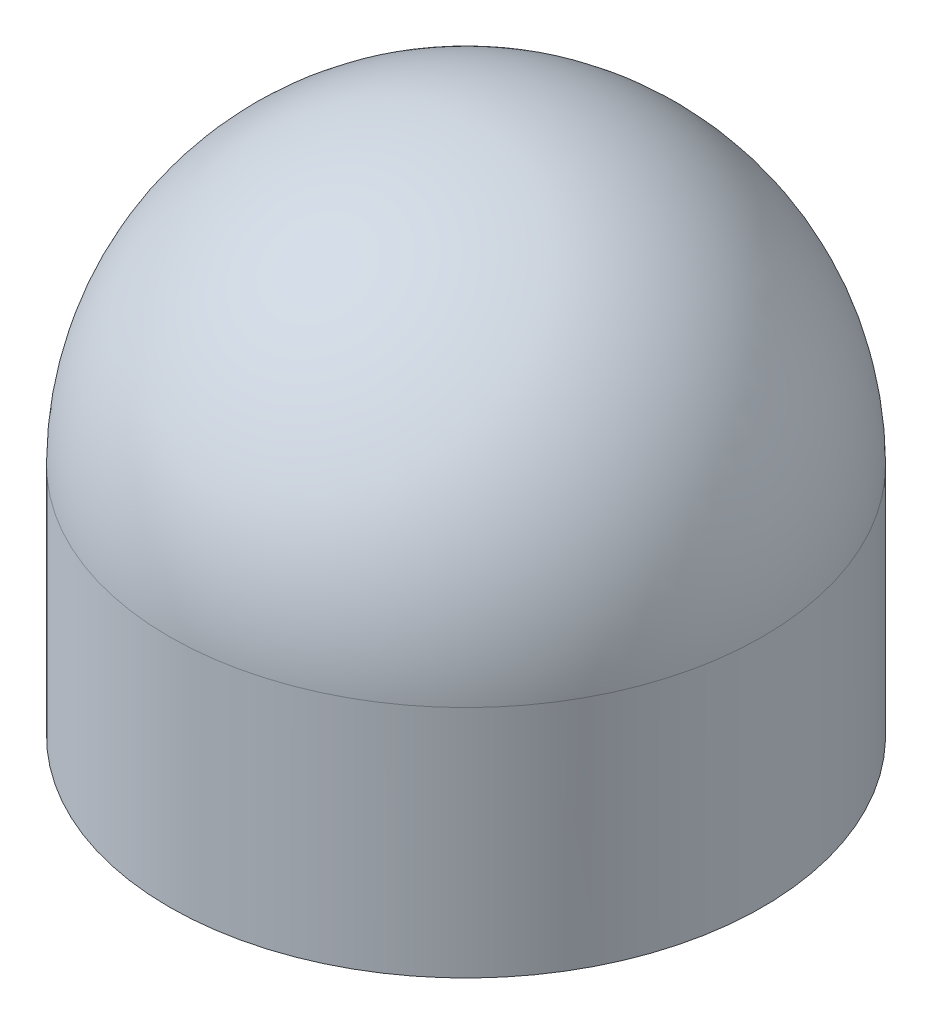
ISO-10303-21;
HEADER;
FILE_DESCRIPTION(('STEP AP214'),'2;1');
FILE_NAME('part.step','',(''),(''),'','','');
FILE_SCHEMA(('AUTOMOTIVE_DESIGN { 1 0 10303 214 1 1 1 1 }'));
ENDSEC;
DATA;
#1=APPLICATION_CONTEXT('core data for automotive mechanical design processes');
#2=APPLICATION_PROTOCOL_DEFINITION('international standard','automotive_design',2000,#1);
#3=PRODUCT_CONTEXT('',#1,'mechanical');
#4=PRODUCT('Part','Part','',(#3));
#5=PRODUCT_RELATED_PRODUCT_CATEGORY('part','',(#4));
#6=PRODUCT_DEFINITION_FORMATION('','',#4);
#7=PRODUCT_DEFINITION_CONTEXT('part definition',#1,'design');
#8=PRODUCT_DEFINITION('design','',#6,#7);
#9=PRODUCT_DEFINITION_SHAPE('','',#8);
#10=(LENGTH_UNIT() NAMED_UNIT(*) SI_UNIT(.MILLI.,.METRE.));
#11=(NAMED_UNIT(*) PLANE_ANGLE_UNIT() SI_UNIT($,.RADIAN.));
#12=(NAMED_UNIT(*) SI_UNIT($,.STERADIAN.) SOLID_ANGLE_UNIT());
#13=UNCERTAINTY_MEASURE_WITH_UNIT(LENGTH_MEASURE(1.E-05),#10,'distance_accuracy_value','');
#14=(GEOMETRIC_REPRESENTATION_CONTEXT(3) GLOBAL_UNCERTAINTY_ASSIGNED_CONTEXT((#13)) GLOBAL_UNIT_ASSIGNED_CONTEXT((#10,
#11,#12)) REPRESENTATION_CONTEXT('',''));
#15=CARTESIAN_POINT('',(0.,0.,0.));
#16=DIRECTION('',(0.,0.,1.));
#17=DIRECTION('',(1.,0.,0.));
#18=AXIS2_PLACEMENT_3D('',#15,#16,#17);
#19=CARTESIAN_POINT('',(0.,0.,0.));
#20=DIRECTION('',(0.,1.,0.));
#21=DIRECTION('',(0.,0.,1.));
#22=AXIS2_PLACEMENT_3D('',#19,#20,#21);
#23=PLANE('',#22);
#24=CARTESIAN_POINT('',(0.,0.,0.));
#25=DIRECTION('',(0.,1.,0.));
#26=DIRECTION('',(0.,0.,1.));
#27=AXIS2_PLACEMENT_3D('',#24,#25,#26);
#28=CIRCLE('',#27,9.652);
#29=CARTESIAN_POINT('',(0.,0.,9.652));
#30=VERTEX_POINT('',#29);
#31=EDGE_CURVE('E10',#30,#30,#28,.T.);
#32=ORIENTED_EDGE('',*,*,#31,.F.);
#33=EDGE_LOOP('',(#32));
#34=FACE_BOUND('',#33,.T.);
#35=ADVANCED_FACE('F41',(#34),#23,.F.);
#36=CARTESIAN_POINT('',(0.,17.272,0.));
#37=DIRECTION('',(0.,1.,0.));
#38=DIRECTION('',(0.,0.,1.));
#39=AXIS2_PLACEMENT_3D('',#36,#37,#38);
#40=CYLINDRICAL_SURFACE('',#39,9.652);
#41=CARTESIAN_POINT('',(0.,7.62,0.));
#42=DIRECTION('',(0.,1.,0.));
#43=DIRECTION('',(0.,0.,1.));
#44=AXIS2_PLACEMENT_3D('',#41,#42,#43);
#45=CIRCLE('',#44,9.652);
#46=CARTESIAN_POINT('',(0.,7.62,9.652));
#47=VERTEX_POINT('',#46);
#48=EDGE_CURVE('E48',#47,#47,#45,.T.);
#49=ORIENTED_EDGE('',*,*,#48,.F.);
#50=EDGE_LOOP('',(#49));
#51=FACE_BOUND('',#50,.T.);
#52=ORIENTED_EDGE('',*,*,#31,.T.);
#53=EDGE_LOOP('',(#52));
#54=FACE_BOUND('',#53,.T.);
#55=ADVANCED_FACE('F60',(#51,#54),#40,.T.);
#56=CARTESIAN_POINT('',(0.,7.62,0.));
#57=DIRECTION('',(0.,1.,0.));
#58=DIRECTION('',(1.,0.,0.));
#59=AXIS2_PLACEMENT_3D('',#56,#57,#58);
#60=SPHERICAL_SURFACE('',#59,9.652);
#61=ORIENTED_EDGE('',*,*,#48,.T.);
#62=EDGE_LOOP('',(#61));
#63=FACE_BOUND('',#62,.T.);
#64=ADVANCED_FACE('F58',(#63),#60,.T.);
#65=CLOSED_SHELL('',(#35,#55,#64));
#66=MANIFOLD_SOLID_BREP('B2',#65);
#67=ADVANCED_BREP_SHAPE_REPRESENTATION('',(#18,#66),#14);
#68=SHAPE_DEFINITION_REPRESENTATION(#9,#67);
ENDSEC;
END-ISO-10303-21;
